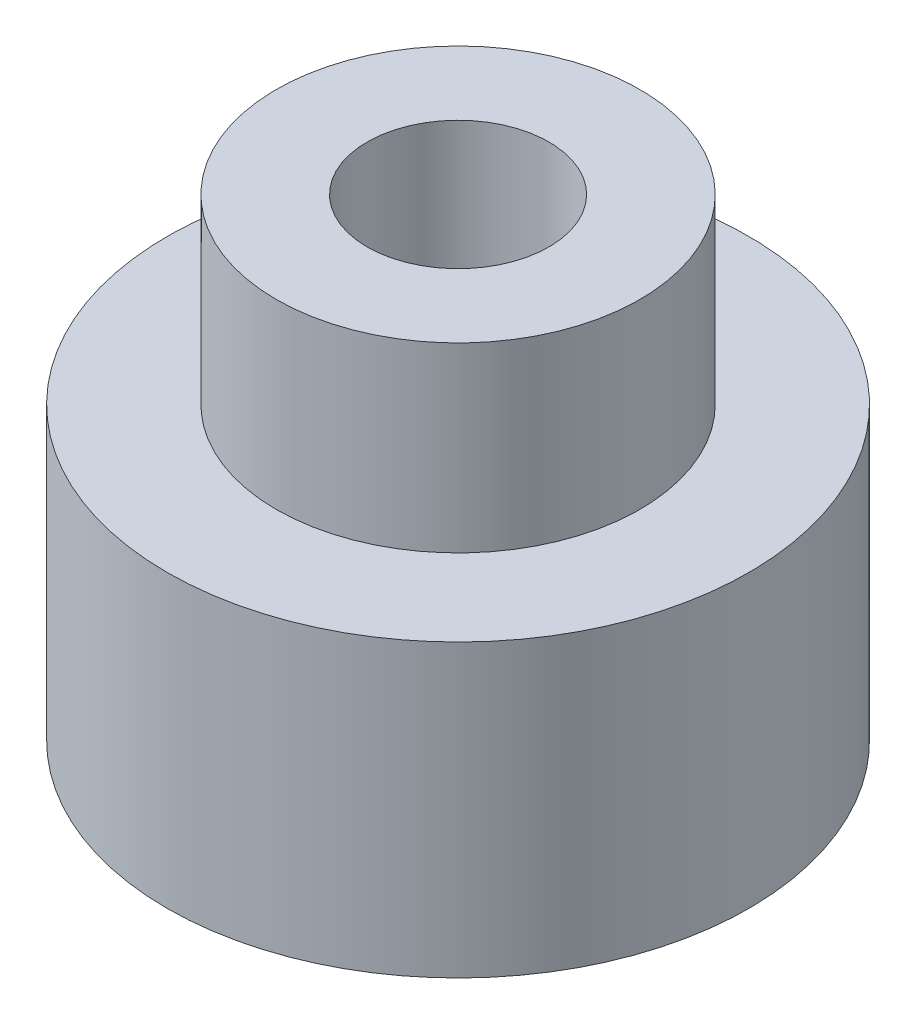
ISO-10303-21;
HEADER;
FILE_DESCRIPTION(('STEP AP214'),'2;1');
FILE_NAME('part.step','',(''),(''),'','','');
FILE_SCHEMA(('AUTOMOTIVE_DESIGN { 1 0 10303 214 1 1 1 1 }'));
ENDSEC;
DATA;
#1=APPLICATION_CONTEXT('core data for automotive mechanical design processes');
#2=APPLICATION_PROTOCOL_DEFINITION('international standard','automotive_design',2000,#1);
#3=PRODUCT_CONTEXT('',#1,'mechanical');
#4=PRODUCT('Part','Part','',(#3));
#5=PRODUCT_RELATED_PRODUCT_CATEGORY('part','',(#4));
#6=PRODUCT_DEFINITION_FORMATION('','',#4);
#7=PRODUCT_DEFINITION_CONTEXT('part definition',#1,'design');
#8=PRODUCT_DEFINITION('design','',#6,#7);
#9=PRODUCT_DEFINITION_SHAPE('','',#8);
#10=(LENGTH_UNIT() NAMED_UNIT(*) SI_UNIT(.MILLI.,.METRE.));
#11=(NAMED_UNIT(*) PLANE_ANGLE_UNIT() SI_UNIT($,.RADIAN.));
#12=(NAMED_UNIT(*) SI_UNIT($,.STERADIAN.) SOLID_ANGLE_UNIT());
#13=UNCERTAINTY_MEASURE_WITH_UNIT(LENGTH_MEASURE(1.E-05),#10,'distance_accuracy_value','');
#14=(GEOMETRIC_REPRESENTATION_CONTEXT(3) GLOBAL_UNCERTAINTY_ASSIGNED_CONTEXT((#13)) GLOBAL_UNIT_ASSIGNED_CONTEXT((#10,
#11,#12)) REPRESENTATION_CONTEXT('',''));
#15=CARTESIAN_POINT('',(0.,0.,0.));
#16=DIRECTION('',(0.,0.,1.));
#17=DIRECTION('',(1.,0.,0.));
#18=AXIS2_PLACEMENT_3D('',#15,#16,#17);
#19=CARTESIAN_POINT('',(0.,8.,0.));
#20=DIRECTION('',(0.,-1.,0.));
#21=DIRECTION('',(0.,0.,-1.));
#22=AXIS2_PLACEMENT_3D('',#19,#20,#21);
#23=CYLINDRICAL_SURFACE('',#22,8.);
#24=CARTESIAN_POINT('',(0.,8.,0.));
#25=DIRECTION('',(0.,1.,0.));
#26=DIRECTION('',(0.,0.,1.));
#27=AXIS2_PLACEMENT_3D('',#24,#25,#26);
#28=CIRCLE('',#27,8.);
#29=CARTESIAN_POINT('',(0.,8.,8.));
#30=VERTEX_POINT('',#29);
#31=EDGE_CURVE('E44',#30,#30,#28,.T.);
#32=ORIENTED_EDGE('',*,*,#31,.F.);
#33=EDGE_LOOP('',(#32));
#34=FACE_BOUND('',#33,.T.);
#35=CARTESIAN_POINT('',(0.,0.,0.));
#36=DIRECTION('',(0.,1.,0.));
#37=DIRECTION('',(0.,0.,1.));
#38=AXIS2_PLACEMENT_3D('',#35,#36,#37);
#39=CIRCLE('',#38,8.);
#40=CARTESIAN_POINT('',(0.,0.,8.));
#41=VERTEX_POINT('',#40);
#42=EDGE_CURVE('E40',#41,#41,#39,.T.);
#43=ORIENTED_EDGE('',*,*,#42,.T.);
#44=EDGE_LOOP('',(#43));
#45=FACE_BOUND('',#44,.T.);
#46=ADVANCED_FACE('F37',(#34,#45),#23,.T.);
#47=CARTESIAN_POINT('',(0.,8.,0.));
#48=DIRECTION('',(0.,1.,0.));
#49=DIRECTION('',(0.,0.,1.));
#50=AXIS2_PLACEMENT_3D('',#47,#48,#49);
#51=PLANE('',#50);
#52=CARTESIAN_POINT('',(0.,8.,0.));
#53=DIRECTION('',(0.,1.,0.));
#54=DIRECTION('',(0.,0.,1.));
#55=AXIS2_PLACEMENT_3D('',#52,#53,#54);
#56=CIRCLE('',#55,5.);
#57=CARTESIAN_POINT('',(0.,8.,5.));
#58=VERTEX_POINT('',#57);
#59=EDGE_CURVE('E10',#58,#58,#56,.T.);
#60=ORIENTED_EDGE('',*,*,#59,.F.);
#61=EDGE_LOOP('',(#60));
#62=FACE_BOUND('',#61,.T.);
#63=ORIENTED_EDGE('',*,*,#31,.T.);
#64=EDGE_LOOP('',(#63));
#65=FACE_BOUND('',#64,.T.);
#66=ADVANCED_FACE('F77',(#62,#65),#51,.T.);
#67=CARTESIAN_POINT('',(0.,0.,0.));
#68=DIRECTION('',(0.,1.,0.));
#69=DIRECTION('',(0.,0.,1.));
#70=AXIS2_PLACEMENT_3D('',#67,#68,#69);
#71=PLANE('',#70);
#72=CARTESIAN_POINT('',(0.,0.,0.));
#73=DIRECTION('',(0.,1.,0.));
#74=DIRECTION('',(0.,0.,1.));
#75=AXIS2_PLACEMENT_3D('',#72,#73,#74);
#76=CIRCLE('',#75,2.5);
#77=CARTESIAN_POINT('',(0.,0.,2.5));
#78=VERTEX_POINT('',#77);
#79=EDGE_CURVE('E53',#78,#78,#76,.F.);
#80=ORIENTED_EDGE('',*,*,#79,.F.);
#81=EDGE_LOOP('',(#80));
#82=FACE_BOUND('',#81,.T.);
#83=ORIENTED_EDGE('',*,*,#42,.F.);
#84=EDGE_LOOP('',(#83));
#85=FACE_BOUND('',#84,.T.);
#86=ADVANCED_FACE('F71',(#82,#85),#71,.F.);
#87=CARTESIAN_POINT('',(0.,13.,0.));
#88=DIRECTION('',(0.,-1.,0.));
#89=DIRECTION('',(0.,0.,-1.));
#90=AXIS2_PLACEMENT_3D('',#87,#88,#89);
#91=CYLINDRICAL_SURFACE('',#90,5.);
#92=CARTESIAN_POINT('',(0.,13.,0.));
#93=DIRECTION('',(0.,1.,0.));
#94=DIRECTION('',(0.,0.,1.));
#95=AXIS2_PLACEMENT_3D('',#92,#93,#94);
#96=CIRCLE('',#95,5.);
#97=CARTESIAN_POINT('',(0.,13.,5.));
#98=VERTEX_POINT('',#97);
#99=EDGE_CURVE('E50',#98,#98,#96,.T.);
#100=ORIENTED_EDGE('',*,*,#99,.F.);
#101=EDGE_LOOP('',(#100));
#102=FACE_BOUND('',#101,.T.);
#103=ORIENTED_EDGE('',*,*,#59,.T.);
#104=EDGE_LOOP('',(#103));
#105=FACE_BOUND('',#104,.T.);
#106=ADVANCED_FACE('F66',(#102,#105),#91,.T.);
#107=CARTESIAN_POINT('',(0.,13.,0.));
#108=DIRECTION('',(0.,1.,0.));
#109=DIRECTION('',(0.,0.,1.));
#110=AXIS2_PLACEMENT_3D('',#107,#108,#109);
#111=PLANE('',#110);
#112=CARTESIAN_POINT('',(0.,13.,0.));
#113=DIRECTION('',(0.,1.,0.));
#114=DIRECTION('',(0.,0.,1.));
#115=AXIS2_PLACEMENT_3D('',#112,#113,#114);
#116=CIRCLE('',#115,2.5);
#117=CARTESIAN_POINT('',(0.,13.,2.5));
#118=VERTEX_POINT('',#117);
#119=EDGE_CURVE('E56',#118,#118,#116,.T.);
#120=ORIENTED_EDGE('',*,*,#119,.F.);
#121=EDGE_LOOP('',(#120));
#122=FACE_BOUND('',#121,.T.);
#123=ORIENTED_EDGE('',*,*,#99,.T.);
#124=EDGE_LOOP('',(#123));
#125=FACE_BOUND('',#124,.T.);
#126=ADVANCED_FACE('F63',(#122,#125),#111,.T.);
#127=CARTESIAN_POINT('',(0.,-0.000999999999999265,0.));
#128=DIRECTION('',(0.,1.,0.));
#129=DIRECTION('',(0.,0.,1.));
#130=AXIS2_PLACEMENT_3D('',#127,#128,#129);
#131=CYLINDRICAL_SURFACE('',#130,2.5);
#132=ORIENTED_EDGE('',*,*,#119,.T.);
#133=EDGE_LOOP('',(#132));
#134=FACE_BOUND('',#133,.T.);
#135=ORIENTED_EDGE('',*,*,#79,.T.);
#136=EDGE_LOOP('',(#135));
#137=FACE_BOUND('',#136,.T.);
#138=ADVANCED_FACE('F60',(#134,#137),#131,.F.);
#139=CLOSED_SHELL('',(#46,#66,#86,#106,#126,#138));
#140=MANIFOLD_SOLID_BREP('B2',#139);
#141=ADVANCED_BREP_SHAPE_REPRESENTATION('',(#18,#140),#14);
#142=SHAPE_DEFINITION_REPRESENTATION(#9,#141);
ENDSEC;
END-ISO-10303-21;
